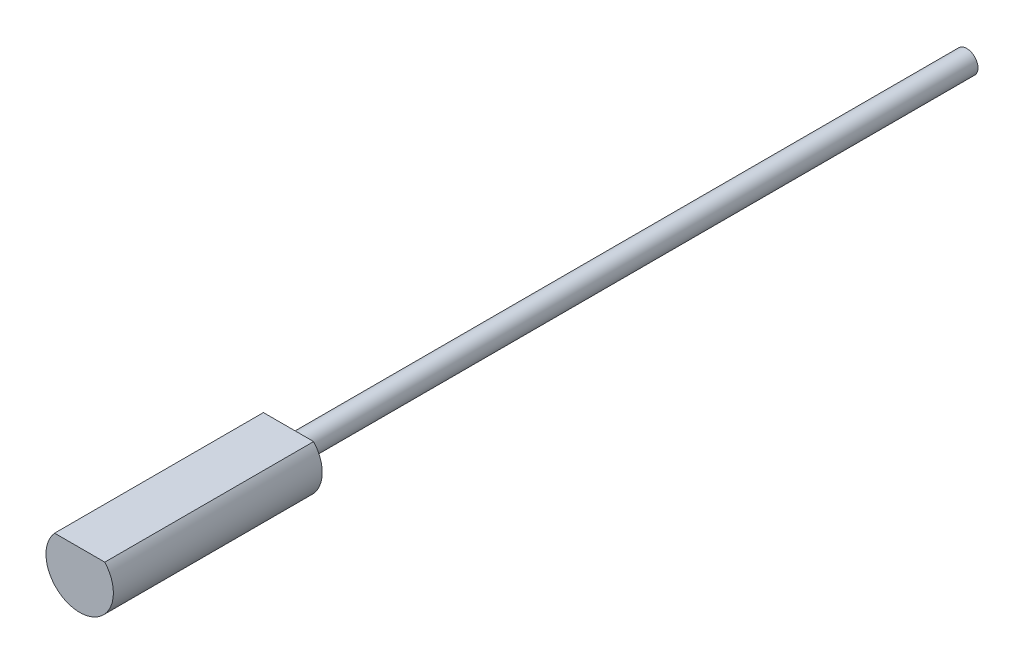
ISO-10303-21;
HEADER;
FILE_DESCRIPTION(('STEP AP214'),'2;1');
FILE_NAME('part.step','',(''),(''),'','','');
FILE_SCHEMA(('AUTOMOTIVE_DESIGN { 1 0 10303 214 1 1 1 1 }'));
ENDSEC;
DATA;
#1=APPLICATION_CONTEXT('core data for automotive mechanical design processes');
#2=APPLICATION_PROTOCOL_DEFINITION('international standard','automotive_design',2000,#1);
#3=PRODUCT_CONTEXT('',#1,'mechanical');
#4=PRODUCT('Part','Part','',(#3));
#5=PRODUCT_RELATED_PRODUCT_CATEGORY('part','',(#4));
#6=PRODUCT_DEFINITION_FORMATION('','',#4);
#7=PRODUCT_DEFINITION_CONTEXT('part definition',#1,'design');
#8=PRODUCT_DEFINITION('design','',#6,#7);
#9=PRODUCT_DEFINITION_SHAPE('','',#8);
#10=(LENGTH_UNIT() NAMED_UNIT(*) SI_UNIT(.MILLI.,.METRE.));
#11=(NAMED_UNIT(*) PLANE_ANGLE_UNIT() SI_UNIT($,.RADIAN.));
#12=(NAMED_UNIT(*) SI_UNIT($,.STERADIAN.) SOLID_ANGLE_UNIT());
#13=UNCERTAINTY_MEASURE_WITH_UNIT(LENGTH_MEASURE(1.E-05),#10,'distance_accuracy_value','');
#14=(GEOMETRIC_REPRESENTATION_CONTEXT(3) GLOBAL_UNCERTAINTY_ASSIGNED_CONTEXT((#13)) GLOBAL_UNIT_ASSIGNED_CONTEXT((#10,
#11,#12)) REPRESENTATION_CONTEXT('',''));
#15=CARTESIAN_POINT('',(0.,0.,0.));
#16=DIRECTION('',(0.,0.,1.));
#17=DIRECTION('',(1.,0.,0.));
#18=AXIS2_PLACEMENT_3D('',#15,#16,#17);
#19=CARTESIAN_POINT('',(0.,0.,30.2));
#20=DIRECTION('',(0.,0.,-1.));
#21=DIRECTION('',(-1.,0.,0.));
#22=AXIS2_PLACEMENT_3D('',#19,#20,#21);
#23=CYLINDRICAL_SURFACE('',#22,0.5);
#24=CARTESIAN_POINT('',(0.,0.,30.2));
#25=DIRECTION('',(0.,0.,1.));
#26=DIRECTION('',(1.,0.,0.));
#27=AXIS2_PLACEMENT_3D('',#24,#25,#26);
#28=CIRCLE('',#27,0.5);
#29=CARTESIAN_POINT('',(0.5,0.,30.2));
#30=VERTEX_POINT('',#29);
#31=EDGE_CURVE('E11',#30,#30,#28,.T.);
#32=ORIENTED_EDGE('',*,*,#31,.F.);
#33=EDGE_LOOP('',(#32));
#34=FACE_BOUND('',#33,.T.);
#35=CARTESIAN_POINT('',(0.,0.,0.));
#36=DIRECTION('',(0.,0.,1.));
#37=DIRECTION('',(1.,0.,0.));
#38=AXIS2_PLACEMENT_3D('',#35,#36,#37);
#39=CIRCLE('',#38,0.5);
#40=CARTESIAN_POINT('',(0.5,0.,0.));
#41=VERTEX_POINT('',#40);
#42=EDGE_CURVE('E44',#41,#41,#39,.T.);
#43=ORIENTED_EDGE('',*,*,#42,.T.);
#44=EDGE_LOOP('',(#43));
#45=FACE_BOUND('',#44,.T.);
#46=ADVANCED_FACE('F41',(#34,#45),#23,.T.);
#47=CARTESIAN_POINT('',(0.,0.,0.));
#48=DIRECTION('',(0.,0.,1.));
#49=DIRECTION('',(1.,0.,0.));
#50=AXIS2_PLACEMENT_3D('',#47,#48,#49);
#51=PLANE('',#50);
#52=ORIENTED_EDGE('',*,*,#42,.F.);
#53=EDGE_LOOP('',(#52));
#54=FACE_BOUND('',#53,.T.);
#55=ADVANCED_FACE('F95',(#54),#51,.F.);
#56=CARTESIAN_POINT('',(0.,1.,39.5));
#57=DIRECTION('',(0.,-1.,0.));
#58=DIRECTION('',(0.,0.,-1.));
#59=AXIS2_PLACEMENT_3D('',#56,#57,#58);
#60=PLANE('',#59);
#61=DIRECTION('',(-1.,0.,0.));
#62=VECTOR('',#61,1.);
#63=CARTESIAN_POINT('',(0.,1.,30.2));
#64=LINE('',#63,#62);
#65=CARTESIAN_POINT('',(1.1180339887499,1.,30.2));
#66=VERTEX_POINT('',#65);
#67=CARTESIAN_POINT('',(-1.1180339887499,1.,30.2));
#68=VERTEX_POINT('',#67);
#69=EDGE_CURVE('E77',#66,#68,#64,.T.);
#70=ORIENTED_EDGE('',*,*,#69,.T.);
#71=DIRECTION('',(0.,0.,-1.));
#72=VECTOR('',#71,1.);
#73=CARTESIAN_POINT('',(-1.1180339887499,1.,39.5));
#74=LINE('',#73,#72);
#75=CARTESIAN_POINT('',(-1.1180339887499,1.,39.5));
#76=VERTEX_POINT('',#75);
#77=EDGE_CURVE('E73',#76,#68,#74,.T.);
#78=ORIENTED_EDGE('',*,*,#77,.F.);
#79=DIRECTION('',(-1.,0.,0.));
#80=VECTOR('',#79,1.);
#81=CARTESIAN_POINT('',(0.,1.,39.5));
#82=LINE('',#81,#80);
#83=CARTESIAN_POINT('',(1.1180339887499,1.,39.5));
#84=VERTEX_POINT('',#83);
#85=EDGE_CURVE('E76',#84,#76,#82,.T.);
#86=ORIENTED_EDGE('',*,*,#85,.F.);
#87=DIRECTION('',(0.,0.,-1.));
#88=VECTOR('',#87,1.);
#89=CARTESIAN_POINT('',(1.1180339887499,1.,39.5));
#90=LINE('',#89,#88);
#91=EDGE_CURVE('E70',#84,#66,#90,.T.);
#92=ORIENTED_EDGE('',*,*,#91,.T.);
#93=EDGE_LOOP('',(#70,#78,#86,#92));
#94=FACE_BOUND('',#93,.T.);
#95=ADVANCED_FACE('F80',(#94),#60,.F.);
#96=CARTESIAN_POINT('',(0.,0.,39.5));
#97=DIRECTION('',(0.,0.,-1.));
#98=DIRECTION('',(-1.,0.,0.));
#99=AXIS2_PLACEMENT_3D('',#96,#97,#98);
#100=CYLINDRICAL_SURFACE('',#99,1.5);
#101=CARTESIAN_POINT('',(0.,0.,30.2));
#102=DIRECTION('',(0.,0.,1.));
#103=DIRECTION('',(1.,0.,0.));
#104=AXIS2_PLACEMENT_3D('',#101,#102,#103);
#105=CIRCLE('',#104,1.5);
#106=EDGE_CURVE('E65',#68,#66,#105,.T.);
#107=ORIENTED_EDGE('',*,*,#106,.T.);
#108=ORIENTED_EDGE('',*,*,#91,.F.);
#109=CARTESIAN_POINT('',(0.,0.,39.5));
#110=DIRECTION('',(0.,0.,1.));
#111=DIRECTION('',(1.,0.,0.));
#112=AXIS2_PLACEMENT_3D('',#109,#110,#111);
#113=CIRCLE('',#112,1.5);
#114=EDGE_CURVE('E57',#76,#84,#113,.T.);
#115=ORIENTED_EDGE('',*,*,#114,.F.);
#116=ORIENTED_EDGE('',*,*,#77,.T.);
#117=EDGE_LOOP('',(#107,#108,#115,#116));
#118=FACE_BOUND('',#117,.T.);
#119=ADVANCED_FACE('F69',(#118),#100,.T.);
#120=CARTESIAN_POINT('',(0.,0.,39.5));
#121=DIRECTION('',(0.,0.,1.));
#122=DIRECTION('',(1.,0.,0.));
#123=AXIS2_PLACEMENT_3D('',#120,#121,#122);
#124=PLANE('',#123);
#125=ORIENTED_EDGE('',*,*,#85,.T.);
#126=ORIENTED_EDGE('',*,*,#114,.T.);
#127=EDGE_LOOP('',(#125,#126));
#128=FACE_BOUND('',#127,.T.);
#129=ADVANCED_FACE('F106',(#128),#124,.T.);
#130=CARTESIAN_POINT('',(0.,0.,30.2));
#131=DIRECTION('',(0.,0.,1.));
#132=DIRECTION('',(1.,0.,0.));
#133=AXIS2_PLACEMENT_3D('',#130,#131,#132);
#134=PLANE('',#133);
#135=ORIENTED_EDGE('',*,*,#31,.T.);
#136=EDGE_LOOP('',(#135));
#137=FACE_BOUND('',#136,.T.);
#138=ORIENTED_EDGE('',*,*,#69,.F.);
#139=ORIENTED_EDGE('',*,*,#106,.F.);
#140=EDGE_LOOP('',(#138,#139));
#141=FACE_BOUND('',#140,.T.);
#142=ADVANCED_FACE('F83',(#137,#141),#134,.F.);
#143=CLOSED_SHELL('',(#46,#55,#95,#119,#129,#142));
#144=MANIFOLD_SOLID_BREP('B2',#143);
#145=ADVANCED_BREP_SHAPE_REPRESENTATION('',(#18,#144),#14);
#146=SHAPE_DEFINITION_REPRESENTATION(#9,#145);
ENDSEC;
END-ISO-10303-21;
